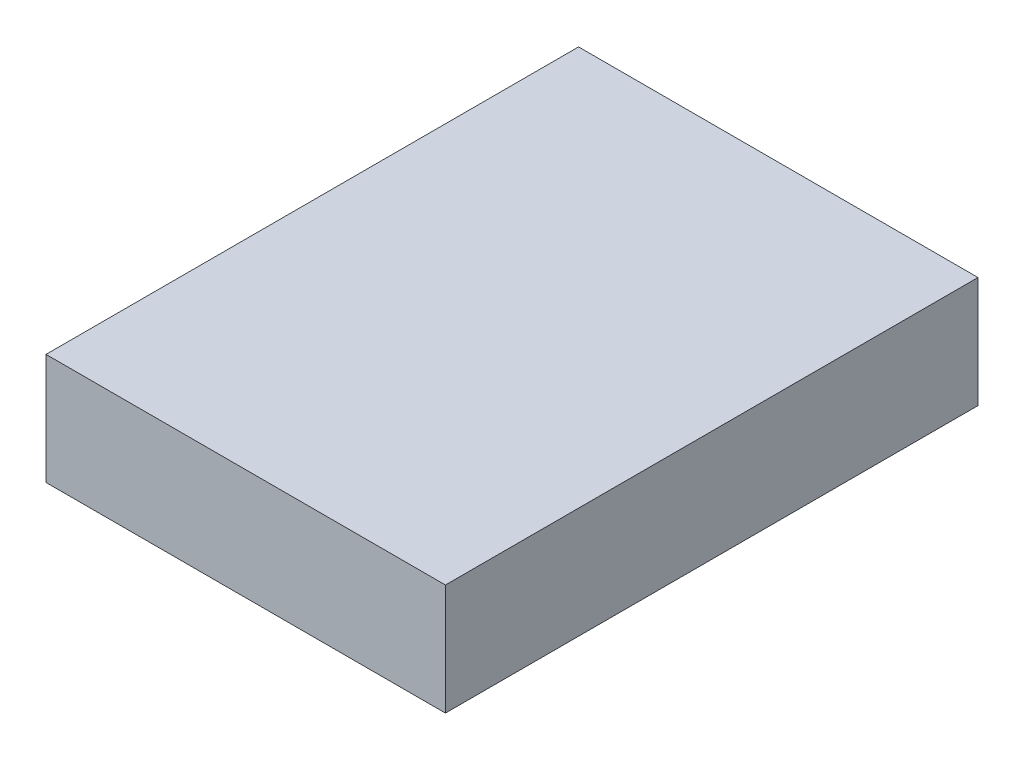
ISO-10303-21;
HEADER;
FILE_DESCRIPTION(('STEP AP214'),'2;1');
FILE_NAME('part.step','',(''),(''),'','','');
FILE_SCHEMA(('AUTOMOTIVE_DESIGN { 1 0 10303 214 1 1 1 1 }'));
ENDSEC;
DATA;
#1=APPLICATION_CONTEXT('core data for automotive mechanical design processes');
#2=APPLICATION_PROTOCOL_DEFINITION('international standard','automotive_design',2000,#1);
#3=PRODUCT_CONTEXT('',#1,'mechanical');
#4=PRODUCT('Part','Part','',(#3));
#5=PRODUCT_RELATED_PRODUCT_CATEGORY('part','',(#4));
#6=PRODUCT_DEFINITION_FORMATION('','',#4);
#7=PRODUCT_DEFINITION_CONTEXT('part definition',#1,'design');
#8=PRODUCT_DEFINITION('design','',#6,#7);
#9=PRODUCT_DEFINITION_SHAPE('','',#8);
#10=(LENGTH_UNIT() NAMED_UNIT(*) SI_UNIT(.MILLI.,.METRE.));
#11=(NAMED_UNIT(*) PLANE_ANGLE_UNIT() SI_UNIT($,.RADIAN.));
#12=(NAMED_UNIT(*) SI_UNIT($,.STERADIAN.) SOLID_ANGLE_UNIT());
#13=UNCERTAINTY_MEASURE_WITH_UNIT(LENGTH_MEASURE(1.E-05),#10,'distance_accuracy_value','');
#14=(GEOMETRIC_REPRESENTATION_CONTEXT(3) GLOBAL_UNCERTAINTY_ASSIGNED_CONTEXT((#13)) GLOBAL_UNIT_ASSIGNED_CONTEXT((#10,
#11,#12)) REPRESENTATION_CONTEXT('',''));
#15=CARTESIAN_POINT('',(0.,0.,0.));
#16=DIRECTION('',(0.,0.,1.));
#17=DIRECTION('',(1.,0.,0.));
#18=AXIS2_PLACEMENT_3D('',#15,#16,#17);
#19=CARTESIAN_POINT('',(9.,5.,-12.));
#20=DIRECTION('',(-1.,0.,0.));
#21=DIRECTION('',(0.,0.,1.));
#22=AXIS2_PLACEMENT_3D('',#19,#20,#21);
#23=PLANE('',#22);
#24=DIRECTION('',(0.,0.,-1.));
#25=VECTOR('',#24,1.);
#26=CARTESIAN_POINT('',(9.,0.,-12.));
#27=LINE('',#26,#25);
#28=CARTESIAN_POINT('',(9.,0.,12.));
#29=VERTEX_POINT('',#28);
#30=CARTESIAN_POINT('',(9.,0.,-12.));
#31=VERTEX_POINT('',#30);
#32=EDGE_CURVE('E113',#29,#31,#27,.T.);
#33=ORIENTED_EDGE('',*,*,#32,.T.);
#34=DIRECTION('',(0.,-1.,0.));
#35=VECTOR('',#34,1.);
#36=CARTESIAN_POINT('',(9.,5.,-12.));
#37=LINE('',#36,#35);
#38=CARTESIAN_POINT('',(9.,5.,-12.));
#39=VERTEX_POINT('',#38);
#40=EDGE_CURVE('E11',#39,#31,#37,.T.);
#41=ORIENTED_EDGE('',*,*,#40,.F.);
#42=DIRECTION('',(0.,0.,-1.));
#43=VECTOR('',#42,1.);
#44=CARTESIAN_POINT('',(9.,5.,-12.));
#45=LINE('',#44,#43);
#46=CARTESIAN_POINT('',(9.,5.,12.));
#47=VERTEX_POINT('',#46);
#48=EDGE_CURVE('E97',#47,#39,#45,.T.);
#49=ORIENTED_EDGE('',*,*,#48,.F.);
#50=DIRECTION('',(0.,-1.,0.));
#51=VECTOR('',#50,1.);
#52=CARTESIAN_POINT('',(9.,5.,12.));
#53=LINE('',#52,#51);
#54=EDGE_CURVE('E109',#47,#29,#53,.T.);
#55=ORIENTED_EDGE('',*,*,#54,.T.);
#56=EDGE_LOOP('',(#33,#41,#49,#55));
#57=FACE_BOUND('',#56,.T.);
#58=ADVANCED_FACE('F45',(#57),#23,.F.);
#59=CARTESIAN_POINT('',(-9.,5.,-12.));
#60=DIRECTION('',(0.,0.,1.));
#61=DIRECTION('',(1.,0.,0.));
#62=AXIS2_PLACEMENT_3D('',#59,#60,#61);
#63=PLANE('',#62);
#64=DIRECTION('',(-1.,0.,0.));
#65=VECTOR('',#64,1.);
#66=CARTESIAN_POINT('',(-9.,0.,-12.));
#67=LINE('',#66,#65);
#68=CARTESIAN_POINT('',(-9.,0.,-12.));
#69=VERTEX_POINT('',#68);
#70=EDGE_CURVE('E102',#31,#69,#67,.T.);
#71=ORIENTED_EDGE('',*,*,#70,.T.);
#72=DIRECTION('',(0.,-1.,0.));
#73=VECTOR('',#72,1.);
#74=CARTESIAN_POINT('',(-9.,5.,-12.));
#75=LINE('',#74,#73);
#76=CARTESIAN_POINT('',(-9.,5.,-12.));
#77=VERTEX_POINT('',#76);
#78=EDGE_CURVE('E54',#77,#69,#75,.T.);
#79=ORIENTED_EDGE('',*,*,#78,.F.);
#80=DIRECTION('',(-1.,0.,0.));
#81=VECTOR('',#80,1.);
#82=CARTESIAN_POINT('',(-9.,5.,-12.));
#83=LINE('',#82,#81);
#84=EDGE_CURVE('E92',#39,#77,#83,.T.);
#85=ORIENTED_EDGE('',*,*,#84,.F.);
#86=ORIENTED_EDGE('',*,*,#40,.T.);
#87=EDGE_LOOP('',(#71,#79,#85,#86));
#88=FACE_BOUND('',#87,.T.);
#89=ADVANCED_FACE('F101',(#88),#63,.F.);
#90=CARTESIAN_POINT('',(-9.,5.,-12.));
#91=DIRECTION('',(1.,0.,0.));
#92=DIRECTION('',(0.,0.,-1.));
#93=AXIS2_PLACEMENT_3D('',#90,#91,#92);
#94=PLANE('',#93);
#95=DIRECTION('',(0.,0.,1.));
#96=VECTOR('',#95,1.);
#97=CARTESIAN_POINT('',(-9.,0.,-12.));
#98=LINE('',#97,#96);
#99=CARTESIAN_POINT('',(-9.,0.,12.));
#100=VERTEX_POINT('',#99);
#101=EDGE_CURVE('E79',#69,#100,#98,.T.);
#102=ORIENTED_EDGE('',*,*,#101,.T.);
#103=DIRECTION('',(0.,-1.,0.));
#104=VECTOR('',#103,1.);
#105=CARTESIAN_POINT('',(-9.,5.,12.));
#106=LINE('',#105,#104);
#107=CARTESIAN_POINT('',(-9.,5.,12.));
#108=VERTEX_POINT('',#107);
#109=EDGE_CURVE('E104',#108,#100,#106,.T.);
#110=ORIENTED_EDGE('',*,*,#109,.F.);
#111=DIRECTION('',(0.,0.,1.));
#112=VECTOR('',#111,1.);
#113=CARTESIAN_POINT('',(-9.,5.,-12.));
#114=LINE('',#113,#112);
#115=EDGE_CURVE('E95',#77,#108,#114,.T.);
#116=ORIENTED_EDGE('',*,*,#115,.F.);
#117=ORIENTED_EDGE('',*,*,#78,.T.);
#118=EDGE_LOOP('',(#102,#110,#116,#117));
#119=FACE_BOUND('',#118,.T.);
#120=ADVANCED_FACE('F105',(#119),#94,.F.);
#121=CARTESIAN_POINT('',(-9.,5.,12.));
#122=DIRECTION('',(0.,0.,-1.));
#123=DIRECTION('',(-1.,0.,0.));
#124=AXIS2_PLACEMENT_3D('',#121,#122,#123);
#125=PLANE('',#124);
#126=DIRECTION('',(1.,0.,0.));
#127=VECTOR('',#126,1.);
#128=CARTESIAN_POINT('',(-9.,0.,12.));
#129=LINE('',#128,#127);
#130=EDGE_CURVE('E85',#100,#29,#129,.T.);
#131=ORIENTED_EDGE('',*,*,#130,.T.);
#132=ORIENTED_EDGE('',*,*,#54,.F.);
#133=DIRECTION('',(1.,0.,0.));
#134=VECTOR('',#133,1.);
#135=CARTESIAN_POINT('',(-9.,5.,12.));
#136=LINE('',#135,#134);
#137=EDGE_CURVE('E62',#108,#47,#136,.T.);
#138=ORIENTED_EDGE('',*,*,#137,.F.);
#139=ORIENTED_EDGE('',*,*,#109,.T.);
#140=EDGE_LOOP('',(#131,#132,#138,#139));
#141=FACE_BOUND('',#140,.T.);
#142=ADVANCED_FACE('F126',(#141),#125,.F.);
#143=CARTESIAN_POINT('',(0.,5.,0.));
#144=DIRECTION('',(0.,1.,0.));
#145=DIRECTION('',(0.,0.,1.));
#146=AXIS2_PLACEMENT_3D('',#143,#144,#145);
#147=PLANE('',#146);
#148=ORIENTED_EDGE('',*,*,#48,.T.);
#149=ORIENTED_EDGE('',*,*,#84,.T.);
#150=ORIENTED_EDGE('',*,*,#115,.T.);
#151=ORIENTED_EDGE('',*,*,#137,.T.);
#152=EDGE_LOOP('',(#148,#149,#150,#151));
#153=FACE_BOUND('',#152,.T.);
#154=ADVANCED_FACE('F93',(#153),#147,.T.);
#155=CARTESIAN_POINT('',(0.,0.,0.));
#156=DIRECTION('',(0.,1.,0.));
#157=DIRECTION('',(0.,0.,1.));
#158=AXIS2_PLACEMENT_3D('',#155,#156,#157);
#159=PLANE('',#158);
#160=ORIENTED_EDGE('',*,*,#32,.F.);
#161=ORIENTED_EDGE('',*,*,#130,.F.);
#162=ORIENTED_EDGE('',*,*,#101,.F.);
#163=ORIENTED_EDGE('',*,*,#70,.F.);
#164=EDGE_LOOP('',(#160,#161,#162,#163));
#165=FACE_BOUND('',#164,.T.);
#166=ADVANCED_FACE('F129',(#165),#159,.F.);
#167=CLOSED_SHELL('',(#58,#89,#120,#142,#154,#166));
#168=MANIFOLD_SOLID_BREP('B2',#167);
#169=ADVANCED_BREP_SHAPE_REPRESENTATION('',(#18,#168),#14);
#170=SHAPE_DEFINITION_REPRESENTATION(#9,#169);
ENDSEC;
END-ISO-10303-21;
